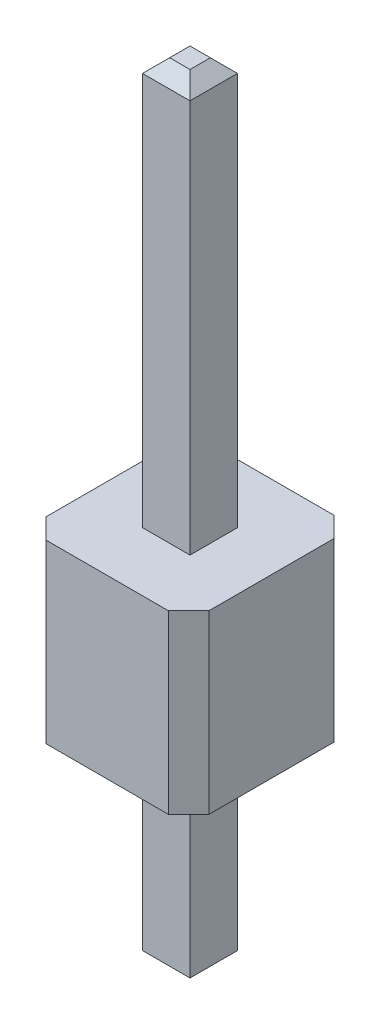
ISO-10303-21;
HEADER;
FILE_DESCRIPTION(('STEP AP214'),'2;1');
FILE_NAME('part.step','',(''),(''),'','','');
FILE_SCHEMA(('AUTOMOTIVE_DESIGN { 1 0 10303 214 1 1 1 1 }'));
ENDSEC;
DATA;
#1=APPLICATION_CONTEXT('core data for automotive mechanical design processes');
#2=APPLICATION_PROTOCOL_DEFINITION('international standard','automotive_design',2000,#1);
#3=PRODUCT_CONTEXT('',#1,'mechanical');
#4=PRODUCT('Part','Part','',(#3));
#5=PRODUCT_RELATED_PRODUCT_CATEGORY('part','',(#4));
#6=PRODUCT_DEFINITION_FORMATION('','',#4);
#7=PRODUCT_DEFINITION_CONTEXT('part definition',#1,'design');
#8=PRODUCT_DEFINITION('design','',#6,#7);
#9=PRODUCT_DEFINITION_SHAPE('','',#8);
#10=(LENGTH_UNIT() NAMED_UNIT(*) SI_UNIT(.MILLI.,.METRE.));
#11=(NAMED_UNIT(*) PLANE_ANGLE_UNIT() SI_UNIT($,.RADIAN.));
#12=(NAMED_UNIT(*) SI_UNIT($,.STERADIAN.) SOLID_ANGLE_UNIT());
#13=UNCERTAINTY_MEASURE_WITH_UNIT(LENGTH_MEASURE(1.E-05),#10,'distance_accuracy_value','');
#14=(GEOMETRIC_REPRESENTATION_CONTEXT(3) GLOBAL_UNCERTAINTY_ASSIGNED_CONTEXT((#13)) GLOBAL_UNIT_ASSIGNED_CONTEXT((#10,
#11,#12)) REPRESENTATION_CONTEXT('',''));
#15=CARTESIAN_POINT('',(0.,0.,0.));
#16=DIRECTION('',(0.,0.,1.));
#17=DIRECTION('',(1.,0.,0.));
#18=AXIS2_PLACEMENT_3D('',#15,#16,#17);
#19=CARTESIAN_POINT('',(0.,0.,0.));
#20=DIRECTION('',(0.,-1.,0.));
#21=DIRECTION('',(0.,0.,-1.));
#22=AXIS2_PLACEMENT_3D('',#19,#20,#21);
#23=PLANE('',#22);
#24=DIRECTION('',(-1.,0.,0.));
#25=VECTOR('',#24,1.);
#26=CARTESIAN_POINT('',(-2.34186046511628,0.,-1.98139534883721));
#27=LINE('',#26,#25);
#28=CARTESIAN_POINT('',(-0.541860465116279,0.,-1.98139534883721));
#29=VERTEX_POINT('',#28);
#30=CARTESIAN_POINT('',(-2.34186046511628,0.,-1.98139534883721));
#31=VERTEX_POINT('',#30);
#32=EDGE_CURVE('E231',#29,#31,#27,.T.);
#33=ORIENTED_EDGE('',*,*,#32,.F.);
#34=DIRECTION('',(-0.707106781186548,0.,-0.707106781186547));
#35=VECTOR('',#34,1.);
#36=CARTESIAN_POINT('',(-0.541860465116279,0.,-1.98139534883721));
#37=LINE('',#36,#35);
#38=CARTESIAN_POINT('',(-0.241860465116279,0.,-1.68139534883721));
#39=VERTEX_POINT('',#38);
#40=EDGE_CURVE('E236',#39,#29,#37,.T.);
#41=ORIENTED_EDGE('',*,*,#40,.F.);
#42=DIRECTION('',(0.,0.,-1.));
#43=VECTOR('',#42,1.);
#44=CARTESIAN_POINT('',(-0.241860465116279,0.,-1.68139534883721));
#45=LINE('',#44,#43);
#46=CARTESIAN_POINT('',(-0.241860465116279,0.,0.158604651162792));
#47=VERTEX_POINT('',#46);
#48=EDGE_CURVE('E263',#47,#39,#45,.T.);
#49=ORIENTED_EDGE('',*,*,#48,.F.);
#50=DIRECTION('',(0.707106781186547,0.,-0.707106781186548));
#51=VECTOR('',#50,1.);
#52=CARTESIAN_POINT('',(-0.541860465116279,0.,0.458604651162792));
#53=LINE('',#52,#51);
#54=CARTESIAN_POINT('',(-0.541860465116279,0.,0.458604651162792));
#55=VERTEX_POINT('',#54);
#56=EDGE_CURVE('E261',#55,#47,#53,.T.);
#57=ORIENTED_EDGE('',*,*,#56,.F.);
#58=DIRECTION('',(1.,0.,0.));
#59=VECTOR('',#58,1.);
#60=CARTESIAN_POINT('',(-2.34186046511628,0.,0.458604651162792));
#61=LINE('',#60,#59);
#62=CARTESIAN_POINT('',(-2.34186046511628,0.,0.458604651162792));
#63=VERTEX_POINT('',#62);
#64=EDGE_CURVE('E259',#63,#55,#61,.T.);
#65=ORIENTED_EDGE('',*,*,#64,.F.);
#66=DIRECTION('',(0.707106781186547,0.,0.707106781186548));
#67=VECTOR('',#66,1.);
#68=CARTESIAN_POINT('',(-2.64186046511628,0.,0.158604651162792));
#69=LINE('',#68,#67);
#70=CARTESIAN_POINT('',(-2.64186046511628,0.,0.158604651162792));
#71=VERTEX_POINT('',#70);
#72=EDGE_CURVE('E257',#71,#63,#69,.T.);
#73=ORIENTED_EDGE('',*,*,#72,.F.);
#74=DIRECTION('',(0.,0.,1.));
#75=VECTOR('',#74,1.);
#76=CARTESIAN_POINT('',(-2.64186046511628,0.,-1.68139534883721));
#77=LINE('',#76,#75);
#78=CARTESIAN_POINT('',(-2.64186046511628,0.,-1.68139534883721));
#79=VERTEX_POINT('',#78);
#80=EDGE_CURVE('E255',#79,#71,#77,.T.);
#81=ORIENTED_EDGE('',*,*,#80,.F.);
#82=DIRECTION('',(-0.707106781186547,0.,0.707106781186547));
#83=VECTOR('',#82,1.);
#84=CARTESIAN_POINT('',(-2.64186046511628,0.,-1.68139534883721));
#85=LINE('',#84,#83);
#86=EDGE_CURVE('E253',#31,#79,#85,.T.);
#87=ORIENTED_EDGE('',*,*,#86,.F.);
#88=EDGE_LOOP('',(#33,#41,#49,#57,#65,#73,#81,#87));
#89=FACE_BOUND('',#88,.T.);
#90=DIRECTION('',(0.,0.,1.));
#91=VECTOR('',#90,1.);
#92=CARTESIAN_POINT('',(-1.09186046511628,0.,-0.411395348837209));
#93=LINE('',#92,#91);
#94=CARTESIAN_POINT('',(-1.09186046511628,0.,-1.11139534883721));
#95=VERTEX_POINT('',#94);
#96=CARTESIAN_POINT('',(-1.09186046511628,0.,-0.411395348837209));
#97=VERTEX_POINT('',#96);
#98=EDGE_CURVE('E182',#95,#97,#93,.T.);
#99=ORIENTED_EDGE('',*,*,#98,.F.);
#100=DIRECTION('',(1.,0.,0.));
#101=VECTOR('',#100,1.);
#102=CARTESIAN_POINT('',(-1.09186046511628,0.,-1.11139534883721));
#103=LINE('',#102,#101);
#104=CARTESIAN_POINT('',(-1.79186046511628,0.,-1.11139534883721));
#105=VERTEX_POINT('',#104);
#106=EDGE_CURVE('E192',#105,#95,#103,.T.);
#107=ORIENTED_EDGE('',*,*,#106,.F.);
#108=DIRECTION('',(0.,0.,-1.));
#109=VECTOR('',#108,1.);
#110=CARTESIAN_POINT('',(-1.79186046511628,0.,-1.11139534883721));
#111=LINE('',#110,#109);
#112=CARTESIAN_POINT('',(-1.79186046511628,0.,-0.411395348837209));
#113=VERTEX_POINT('',#112);
#114=EDGE_CURVE('E204',#113,#105,#111,.T.);
#115=ORIENTED_EDGE('',*,*,#114,.F.);
#116=DIRECTION('',(-1.,0.,0.));
#117=VECTOR('',#116,1.);
#118=CARTESIAN_POINT('',(-1.79186046511628,0.,-0.411395348837209));
#119=LINE('',#118,#117);
#120=EDGE_CURVE('E202',#97,#113,#119,.T.);
#121=ORIENTED_EDGE('',*,*,#120,.F.);
#122=EDGE_LOOP('',(#99,#107,#115,#121));
#123=FACE_BOUND('',#122,.T.);
#124=ADVANCED_FACE('F40',(#89,#123),#23,.T.);
#125=CARTESIAN_POINT('',(0.,2.6,0.));
#126=DIRECTION('',(0.,-1.,0.));
#127=DIRECTION('',(0.,0.,-1.));
#128=AXIS2_PLACEMENT_3D('',#125,#126,#127);
#129=PLANE('',#128);
#130=DIRECTION('',(-1.,0.,0.));
#131=VECTOR('',#130,1.);
#132=CARTESIAN_POINT('',(-2.34186046511628,2.6,-1.98139534883721));
#133=LINE('',#132,#131);
#134=CARTESIAN_POINT('',(-0.541860465116279,2.6,-1.98139534883721));
#135=VERTEX_POINT('',#134);
#136=CARTESIAN_POINT('',(-2.34186046511628,2.6,-1.98139534883721));
#137=VERTEX_POINT('',#136);
#138=EDGE_CURVE('E232',#135,#137,#133,.T.);
#139=ORIENTED_EDGE('',*,*,#138,.T.);
#140=DIRECTION('',(-0.707106781186547,0.,0.707106781186547));
#141=VECTOR('',#140,1.);
#142=CARTESIAN_POINT('',(-2.64186046511628,2.6,-1.68139534883721));
#143=LINE('',#142,#141);
#144=CARTESIAN_POINT('',(-2.64186046511628,2.6,-1.68139534883721));
#145=VERTEX_POINT('',#144);
#146=EDGE_CURVE('E235',#137,#145,#143,.T.);
#147=ORIENTED_EDGE('',*,*,#146,.T.);
#148=DIRECTION('',(0.,0.,1.));
#149=VECTOR('',#148,1.);
#150=CARTESIAN_POINT('',(-2.64186046511628,2.6,-1.68139534883721));
#151=LINE('',#150,#149);
#152=CARTESIAN_POINT('',(-2.64186046511628,2.6,0.158604651162792));
#153=VERTEX_POINT('',#152);
#154=EDGE_CURVE('E238',#145,#153,#151,.T.);
#155=ORIENTED_EDGE('',*,*,#154,.T.);
#156=DIRECTION('',(0.707106781186547,0.,0.707106781186548));
#157=VECTOR('',#156,1.);
#158=CARTESIAN_POINT('',(-2.64186046511628,2.6,0.158604651162792));
#159=LINE('',#158,#157);
#160=CARTESIAN_POINT('',(-2.34186046511628,2.6,0.458604651162792));
#161=VERTEX_POINT('',#160);
#162=EDGE_CURVE('E240',#153,#161,#159,.T.);
#163=ORIENTED_EDGE('',*,*,#162,.T.);
#164=DIRECTION('',(1.,0.,0.));
#165=VECTOR('',#164,1.);
#166=CARTESIAN_POINT('',(-2.34186046511628,2.6,0.458604651162792));
#167=LINE('',#166,#165);
#168=CARTESIAN_POINT('',(-0.541860465116279,2.6,0.458604651162792));
#169=VERTEX_POINT('',#168);
#170=EDGE_CURVE('E242',#161,#169,#167,.T.);
#171=ORIENTED_EDGE('',*,*,#170,.T.);
#172=DIRECTION('',(0.707106781186547,0.,-0.707106781186548));
#173=VECTOR('',#172,1.);
#174=CARTESIAN_POINT('',(-0.541860465116279,2.6,0.458604651162792));
#175=LINE('',#174,#173);
#176=CARTESIAN_POINT('',(-0.241860465116279,2.6,0.158604651162792));
#177=VERTEX_POINT('',#176);
#178=EDGE_CURVE('E244',#169,#177,#175,.T.);
#179=ORIENTED_EDGE('',*,*,#178,.T.);
#180=DIRECTION('',(0.,0.,-1.));
#181=VECTOR('',#180,1.);
#182=CARTESIAN_POINT('',(-0.241860465116279,2.6,-1.68139534883721));
#183=LINE('',#182,#181);
#184=CARTESIAN_POINT('',(-0.241860465116279,2.6,-1.68139534883721));
#185=VERTEX_POINT('',#184);
#186=EDGE_CURVE('E246',#177,#185,#183,.T.);
#187=ORIENTED_EDGE('',*,*,#186,.T.);
#188=DIRECTION('',(-0.707106781186548,0.,-0.707106781186547));
#189=VECTOR('',#188,1.);
#190=CARTESIAN_POINT('',(-0.541860465116279,2.6,-1.98139534883721));
#191=LINE('',#190,#189);
#192=EDGE_CURVE('E248',#185,#135,#191,.T.);
#193=ORIENTED_EDGE('',*,*,#192,.T.);
#194=EDGE_LOOP('',(#139,#147,#155,#163,#171,#179,#187,#193));
#195=FACE_BOUND('',#194,.T.);
#196=DIRECTION('',(0.,0.,-1.));
#197=VECTOR('',#196,1.);
#198=CARTESIAN_POINT('',(-1.09186046511628,2.6,-1.11139534883721));
#199=LINE('',#198,#197);
#200=CARTESIAN_POINT('',(-1.09186046511628,2.6,-0.411395348837209));
#201=VERTEX_POINT('',#200);
#202=CARTESIAN_POINT('',(-1.09186046511628,2.6,-1.11139534883721));
#203=VERTEX_POINT('',#202);
#204=EDGE_CURVE('E188',#201,#203,#199,.T.);
#205=ORIENTED_EDGE('',*,*,#204,.F.);
#206=DIRECTION('',(1.,0.,0.));
#207=VECTOR('',#206,1.);
#208=CARTESIAN_POINT('',(-1.79186046511628,2.6,-0.411395348837209));
#209=LINE('',#208,#207);
#210=CARTESIAN_POINT('',(-1.79186046511628,2.6,-0.411395348837209));
#211=VERTEX_POINT('',#210);
#212=EDGE_CURVE('E220',#211,#201,#209,.T.);
#213=ORIENTED_EDGE('',*,*,#212,.F.);
#214=DIRECTION('',(0.,0.,1.));
#215=VECTOR('',#214,1.);
#216=CARTESIAN_POINT('',(-1.79186046511628,2.6,-1.11139534883721));
#217=LINE('',#216,#215);
#218=CARTESIAN_POINT('',(-1.79186046511628,2.6,-1.11139534883721));
#219=VERTEX_POINT('',#218);
#220=EDGE_CURVE('E217',#219,#211,#217,.T.);
#221=ORIENTED_EDGE('',*,*,#220,.F.);
#222=DIRECTION('',(-1.,0.,0.));
#223=VECTOR('',#222,1.);
#224=CARTESIAN_POINT('',(-1.79186046511628,2.6,-1.11139534883721));
#225=LINE('',#224,#223);
#226=EDGE_CURVE('E214',#203,#219,#225,.T.);
#227=ORIENTED_EDGE('',*,*,#226,.F.);
#228=EDGE_LOOP('',(#205,#213,#221,#227));
#229=FACE_BOUND('',#228,.T.);
#230=ADVANCED_FACE('F372',(#195,#229),#129,.F.);
#231=CARTESIAN_POINT('',(-2.34186046511628,2.6,-1.98139534883721));
#232=DIRECTION('',(0.,0.,1.));
#233=DIRECTION('',(1.,0.,0.));
#234=AXIS2_PLACEMENT_3D('',#231,#232,#233);
#235=PLANE('',#234);
#236=ORIENTED_EDGE('',*,*,#32,.T.);
#237=DIRECTION('',(0.,-1.,0.));
#238=VECTOR('',#237,1.);
#239=CARTESIAN_POINT('',(-2.34186046511628,2.6,-1.98139534883721));
#240=LINE('',#239,#238);
#241=EDGE_CURVE('E286',#137,#31,#240,.T.);
#242=ORIENTED_EDGE('',*,*,#241,.F.);
#243=ORIENTED_EDGE('',*,*,#138,.F.);
#244=DIRECTION('',(0.,-1.,0.));
#245=VECTOR('',#244,1.);
#246=CARTESIAN_POINT('',(-0.541860465116279,2.6,-1.98139534883721));
#247=LINE('',#246,#245);
#248=EDGE_CURVE('E250',#135,#29,#247,.T.);
#249=ORIENTED_EDGE('',*,*,#248,.T.);
#250=EDGE_LOOP('',(#236,#242,#243,#249));
#251=FACE_BOUND('',#250,.T.);
#252=ADVANCED_FACE('F378',(#251),#235,.F.);
#253=CARTESIAN_POINT('',(-2.64186046511628,2.6,-1.68139534883721));
#254=DIRECTION('',(0.707106781186548,0.,0.707106781186548));
#255=DIRECTION('',(0.707106781186548,0.,-0.707106781186548));
#256=AXIS2_PLACEMENT_3D('',#253,#254,#255);
#257=PLANE('',#256);
#258=ORIENTED_EDGE('',*,*,#86,.T.);
#259=DIRECTION('',(0.,-1.,0.));
#260=VECTOR('',#259,1.);
#261=CARTESIAN_POINT('',(-2.64186046511628,2.6,-1.68139534883721));
#262=LINE('',#261,#260);
#263=EDGE_CURVE('E283',#145,#79,#262,.T.);
#264=ORIENTED_EDGE('',*,*,#263,.F.);
#265=ORIENTED_EDGE('',*,*,#146,.F.);
#266=ORIENTED_EDGE('',*,*,#241,.T.);
#267=EDGE_LOOP('',(#258,#264,#265,#266));
#268=FACE_BOUND('',#267,.T.);
#269=ADVANCED_FACE('F407',(#268),#257,.F.);
#270=CARTESIAN_POINT('',(-2.64186046511628,2.6,-1.68139534883721));
#271=DIRECTION('',(1.,0.,0.));
#272=DIRECTION('',(0.,0.,-1.));
#273=AXIS2_PLACEMENT_3D('',#270,#271,#272);
#274=PLANE('',#273);
#275=ORIENTED_EDGE('',*,*,#80,.T.);
#276=DIRECTION('',(0.,-1.,0.));
#277=VECTOR('',#276,1.);
#278=CARTESIAN_POINT('',(-2.64186046511628,2.6,0.158604651162792));
#279=LINE('',#278,#277);
#280=EDGE_CURVE('E280',#153,#71,#279,.T.);
#281=ORIENTED_EDGE('',*,*,#280,.F.);
#282=ORIENTED_EDGE('',*,*,#154,.F.);
#283=ORIENTED_EDGE('',*,*,#263,.T.);
#284=EDGE_LOOP('',(#275,#281,#282,#283));
#285=FACE_BOUND('',#284,.T.);
#286=ADVANCED_FACE('F403',(#285),#274,.F.);
#287=CARTESIAN_POINT('',(-2.64186046511628,2.6,0.158604651162792));
#288=DIRECTION('',(0.707106781186548,0.,-0.707106781186547));
#289=DIRECTION('',(-0.707106781186547,0.,-0.707106781186548));
#290=AXIS2_PLACEMENT_3D('',#287,#288,#289);
#291=PLANE('',#290);
#292=ORIENTED_EDGE('',*,*,#72,.T.);
#293=DIRECTION('',(0.,-1.,0.));
#294=VECTOR('',#293,1.);
#295=CARTESIAN_POINT('',(-2.34186046511628,2.6,0.458604651162792));
#296=LINE('',#295,#294);
#297=EDGE_CURVE('E277',#161,#63,#296,.T.);
#298=ORIENTED_EDGE('',*,*,#297,.F.);
#299=ORIENTED_EDGE('',*,*,#162,.F.);
#300=ORIENTED_EDGE('',*,*,#280,.T.);
#301=EDGE_LOOP('',(#292,#298,#299,#300));
#302=FACE_BOUND('',#301,.T.);
#303=ADVANCED_FACE('F399',(#302),#291,.F.);
#304=CARTESIAN_POINT('',(-2.34186046511628,2.6,0.458604651162792));
#305=DIRECTION('',(0.,0.,-1.));
#306=DIRECTION('',(-1.,0.,0.));
#307=AXIS2_PLACEMENT_3D('',#304,#305,#306);
#308=PLANE('',#307);
#309=ORIENTED_EDGE('',*,*,#64,.T.);
#310=DIRECTION('',(0.,-1.,0.));
#311=VECTOR('',#310,1.);
#312=CARTESIAN_POINT('',(-0.541860465116279,2.6,0.458604651162792));
#313=LINE('',#312,#311);
#314=EDGE_CURVE('E274',#169,#55,#313,.T.);
#315=ORIENTED_EDGE('',*,*,#314,.F.);
#316=ORIENTED_EDGE('',*,*,#170,.F.);
#317=ORIENTED_EDGE('',*,*,#297,.T.);
#318=EDGE_LOOP('',(#309,#315,#316,#317));
#319=FACE_BOUND('',#318,.T.);
#320=ADVANCED_FACE('F395',(#319),#308,.F.);
#321=CARTESIAN_POINT('',(-0.541860465116279,2.6,0.458604651162792));
#322=DIRECTION('',(-0.707106781186548,0.,-0.707106781186547));
#323=DIRECTION('',(-0.707106781186547,0.,0.707106781186548));
#324=AXIS2_PLACEMENT_3D('',#321,#322,#323);
#325=PLANE('',#324);
#326=ORIENTED_EDGE('',*,*,#56,.T.);
#327=DIRECTION('',(0.,-1.,0.));
#328=VECTOR('',#327,1.);
#329=CARTESIAN_POINT('',(-0.241860465116279,2.6,0.158604651162792));
#330=LINE('',#329,#328);
#331=EDGE_CURVE('E271',#177,#47,#330,.T.);
#332=ORIENTED_EDGE('',*,*,#331,.F.);
#333=ORIENTED_EDGE('',*,*,#178,.F.);
#334=ORIENTED_EDGE('',*,*,#314,.T.);
#335=EDGE_LOOP('',(#326,#332,#333,#334));
#336=FACE_BOUND('',#335,.T.);
#337=ADVANCED_FACE('F391',(#336),#325,.F.);
#338=CARTESIAN_POINT('',(-0.241860465116279,2.6,-1.68139534883721));
#339=DIRECTION('',(-1.,0.,0.));
#340=DIRECTION('',(0.,0.,1.));
#341=AXIS2_PLACEMENT_3D('',#338,#339,#340);
#342=PLANE('',#341);
#343=ORIENTED_EDGE('',*,*,#48,.T.);
#344=DIRECTION('',(0.,-1.,0.));
#345=VECTOR('',#344,1.);
#346=CARTESIAN_POINT('',(-0.241860465116279,2.6,-1.68139534883721));
#347=LINE('',#346,#345);
#348=EDGE_CURVE('E268',#185,#39,#347,.T.);
#349=ORIENTED_EDGE('',*,*,#348,.F.);
#350=ORIENTED_EDGE('',*,*,#186,.F.);
#351=ORIENTED_EDGE('',*,*,#331,.T.);
#352=EDGE_LOOP('',(#343,#349,#350,#351));
#353=FACE_BOUND('',#352,.T.);
#354=ADVANCED_FACE('F387',(#353),#342,.F.);
#355=CARTESIAN_POINT('',(-0.541860465116279,2.6,-1.98139534883721));
#356=DIRECTION('',(-0.707106781186547,0.,0.707106781186548));
#357=DIRECTION('',(0.707106781186548,0.,0.707106781186547));
#358=AXIS2_PLACEMENT_3D('',#355,#356,#357);
#359=PLANE('',#358);
#360=ORIENTED_EDGE('',*,*,#40,.T.);
#361=ORIENTED_EDGE('',*,*,#248,.F.);
#362=ORIENTED_EDGE('',*,*,#192,.F.);
#363=ORIENTED_EDGE('',*,*,#348,.T.);
#364=EDGE_LOOP('',(#360,#361,#362,#363));
#365=FACE_BOUND('',#364,.T.);
#366=ADVANCED_FACE('F384',(#365),#359,.F.);
#367=CARTESIAN_POINT('',(-1.09186046511628,8.6,-1.11139534883721));
#368=DIRECTION('',(-1.,0.,0.));
#369=DIRECTION('',(0.,0.,1.));
#370=AXIS2_PLACEMENT_3D('',#367,#368,#369);
#371=PLANE('',#370);
#372=DIRECTION('',(0.,-1.,0.));
#373=VECTOR('',#372,1.);
#374=CARTESIAN_POINT('',(-1.09186046511628,8.6,-1.11139534883721));
#375=LINE('',#374,#373);
#376=CARTESIAN_POINT('',(-1.09186046511628,8.4,-1.11139534883721));
#377=VERTEX_POINT('',#376);
#378=EDGE_CURVE('E229',#377,#203,#375,.T.);
#379=ORIENTED_EDGE('',*,*,#378,.F.);
#380=DIRECTION('',(0.,0.,1.));
#381=VECTOR('',#380,1.);
#382=CARTESIAN_POINT('',(-1.09186046511628,8.4,-0.411395348837209));
#383=LINE('',#382,#381);
#384=CARTESIAN_POINT('',(-1.09186046511628,8.4,-0.411395348837209));
#385=VERTEX_POINT('',#384);
#386=EDGE_CURVE('E318',#377,#385,#383,.T.);
#387=ORIENTED_EDGE('',*,*,#386,.T.);
#388=DIRECTION('',(0.,-1.,0.));
#389=VECTOR('',#388,1.);
#390=CARTESIAN_POINT('',(-1.09186046511628,8.6,-0.411395348837209));
#391=LINE('',#390,#389);
#392=EDGE_CURVE('E223',#385,#201,#391,.T.);
#393=ORIENTED_EDGE('',*,*,#392,.T.);
#394=ORIENTED_EDGE('',*,*,#204,.T.);
#395=EDGE_LOOP('',(#379,#387,#393,#394));
#396=FACE_BOUND('',#395,.T.);
#397=ADVANCED_FACE('F351',(#396),#371,.F.);
#398=CARTESIAN_POINT('',(-1.79186046511628,8.6,-1.11139534883721));
#399=DIRECTION('',(0.,0.,1.));
#400=DIRECTION('',(1.,0.,0.));
#401=AXIS2_PLACEMENT_3D('',#398,#399,#400);
#402=PLANE('',#401);
#403=DIRECTION('',(0.,-1.,0.));
#404=VECTOR('',#403,1.);
#405=CARTESIAN_POINT('',(-1.79186046511628,8.6,-1.11139534883721));
#406=LINE('',#405,#404);
#407=CARTESIAN_POINT('',(-1.79186046511628,8.4,-1.11139534883721));
#408=VERTEX_POINT('',#407);
#409=EDGE_CURVE('E227',#408,#219,#406,.T.);
#410=ORIENTED_EDGE('',*,*,#409,.F.);
#411=DIRECTION('',(1.,0.,0.));
#412=VECTOR('',#411,1.);
#413=CARTESIAN_POINT('',(-1.09186046511628,8.4,-1.11139534883721));
#414=LINE('',#413,#412);
#415=EDGE_CURVE('E49',#408,#377,#414,.T.);
#416=ORIENTED_EDGE('',*,*,#415,.T.);
#417=ORIENTED_EDGE('',*,*,#378,.T.);
#418=ORIENTED_EDGE('',*,*,#226,.T.);
#419=EDGE_LOOP('',(#410,#416,#417,#418));
#420=FACE_BOUND('',#419,.T.);
#421=ADVANCED_FACE('F571',(#420),#402,.F.);
#422=CARTESIAN_POINT('',(-1.79186046511628,8.6,-1.11139534883721));
#423=DIRECTION('',(1.,0.,0.));
#424=DIRECTION('',(0.,0.,-1.));
#425=AXIS2_PLACEMENT_3D('',#422,#423,#424);
#426=PLANE('',#425);
#427=DIRECTION('',(0.,-1.,0.));
#428=VECTOR('',#427,1.);
#429=CARTESIAN_POINT('',(-1.79186046511628,8.6,-0.411395348837209));
#430=LINE('',#429,#428);
#431=CARTESIAN_POINT('',(-1.79186046511628,8.4,-0.411395348837209));
#432=VERTEX_POINT('',#431);
#433=EDGE_CURVE('E225',#432,#211,#430,.T.);
#434=ORIENTED_EDGE('',*,*,#433,.F.);
#435=DIRECTION('',(0.,0.,-1.));
#436=VECTOR('',#435,1.);
#437=CARTESIAN_POINT('',(-1.79186046511628,8.4,-1.11139534883721));
#438=LINE('',#437,#436);
#439=EDGE_CURVE('E11',#432,#408,#438,.T.);
#440=ORIENTED_EDGE('',*,*,#439,.T.);
#441=ORIENTED_EDGE('',*,*,#409,.T.);
#442=ORIENTED_EDGE('',*,*,#220,.T.);
#443=EDGE_LOOP('',(#434,#440,#441,#442));
#444=FACE_BOUND('',#443,.T.);
#445=ADVANCED_FACE('F369',(#444),#426,.F.);
#446=CARTESIAN_POINT('',(-1.79186046511628,8.6,-0.411395348837209));
#447=DIRECTION('',(0.,0.,-1.));
#448=DIRECTION('',(-1.,0.,0.));
#449=AXIS2_PLACEMENT_3D('',#446,#447,#448);
#450=PLANE('',#449);
#451=ORIENTED_EDGE('',*,*,#392,.F.);
#452=DIRECTION('',(-1.,0.,0.));
#453=VECTOR('',#452,1.);
#454=CARTESIAN_POINT('',(-1.79186046511628,8.4,-0.411395348837209));
#455=LINE('',#454,#453);
#456=EDGE_CURVE('E315',#385,#432,#455,.T.);
#457=ORIENTED_EDGE('',*,*,#456,.T.);
#458=ORIENTED_EDGE('',*,*,#433,.T.);
#459=ORIENTED_EDGE('',*,*,#212,.T.);
#460=EDGE_LOOP('',(#451,#457,#458,#459));
#461=FACE_BOUND('',#460,.T.);
#462=ADVANCED_FACE('F355',(#461),#450,.F.);
#463=CARTESIAN_POINT('',(0.,8.6,0.));
#464=DIRECTION('',(0.,1.,0.));
#465=DIRECTION('',(0.,0.,1.));
#466=AXIS2_PLACEMENT_3D('',#463,#464,#465);
#467=PLANE('',#466);
#468=DIRECTION('',(0.,0.,1.));
#469=VECTOR('',#468,1.);
#470=CARTESIAN_POINT('',(-1.59186046511628,8.6,-0.411395348837209));
#471=LINE('',#470,#469);
#472=CARTESIAN_POINT('',(-1.59186046511628,8.6,-0.91139534883721));
#473=VERTEX_POINT('',#472);
#474=CARTESIAN_POINT('',(-1.59186046511628,8.6,-0.611395348837207));
#475=VERTEX_POINT('',#474);
#476=EDGE_CURVE('E306',#473,#475,#471,.T.);
#477=ORIENTED_EDGE('',*,*,#476,.T.);
#478=DIRECTION('',(1.,0.,0.));
#479=VECTOR('',#478,1.);
#480=CARTESIAN_POINT('',(-1.09186046511628,8.6,-0.611395348837207));
#481=LINE('',#480,#479);
#482=CARTESIAN_POINT('',(-1.29186046511628,8.6,-0.611395348837207));
#483=VERTEX_POINT('',#482);
#484=EDGE_CURVE('E312',#475,#483,#481,.T.);
#485=ORIENTED_EDGE('',*,*,#484,.T.);
#486=DIRECTION('',(0.,0.,-1.));
#487=VECTOR('',#486,1.);
#488=CARTESIAN_POINT('',(-1.29186046511628,8.6,-1.11139534883721));
#489=LINE('',#488,#487);
#490=CARTESIAN_POINT('',(-1.29186046511628,8.6,-0.91139534883721));
#491=VERTEX_POINT('',#490);
#492=EDGE_CURVE('E310',#483,#491,#489,.T.);
#493=ORIENTED_EDGE('',*,*,#492,.T.);
#494=DIRECTION('',(-1.,0.,0.));
#495=VECTOR('',#494,1.);
#496=CARTESIAN_POINT('',(-1.79186046511628,8.6,-0.91139534883721));
#497=LINE('',#496,#495);
#498=EDGE_CURVE('E308',#491,#473,#497,.T.);
#499=ORIENTED_EDGE('',*,*,#498,.T.);
#500=EDGE_LOOP('',(#477,#485,#493,#499));
#501=FACE_BOUND('',#500,.T.);
#502=ADVANCED_FACE('F361',(#501),#467,.T.);
#503=CARTESIAN_POINT('',(-1.09186046511628,-3.,-1.11139534883721));
#504=DIRECTION('',(0.,0.,1.));
#505=DIRECTION('',(1.,0.,0.));
#506=AXIS2_PLACEMENT_3D('',#503,#504,#505);
#507=PLANE('',#506);
#508=DIRECTION('',(0.,1.,0.));
#509=VECTOR('',#508,1.);
#510=CARTESIAN_POINT('',(-1.09186046511628,-3.,-1.11139534883721));
#511=LINE('',#510,#509);
#512=CARTESIAN_POINT('',(-1.09186046511628,-2.8,-1.11139534883721));
#513=VERTEX_POINT('',#512);
#514=EDGE_CURVE('E177',#513,#95,#511,.T.);
#515=ORIENTED_EDGE('',*,*,#514,.F.);
#516=DIRECTION('',(-1.,0.,0.));
#517=VECTOR('',#516,1.);
#518=CARTESIAN_POINT('',(-1.09186046511628,-2.8,-1.11139534883721));
#519=LINE('',#518,#517);
#520=CARTESIAN_POINT('',(-1.79186046511628,-2.8,-1.11139534883721));
#521=VERTEX_POINT('',#520);
#522=EDGE_CURVE('E304',#513,#521,#519,.T.);
#523=ORIENTED_EDGE('',*,*,#522,.T.);
#524=DIRECTION('',(0.,1.,0.));
#525=VECTOR('',#524,1.);
#526=CARTESIAN_POINT('',(-1.79186046511628,-3.,-1.11139534883721));
#527=LINE('',#526,#525);
#528=EDGE_CURVE('E195',#521,#105,#527,.T.);
#529=ORIENTED_EDGE('',*,*,#528,.T.);
#530=ORIENTED_EDGE('',*,*,#106,.T.);
#531=EDGE_LOOP('',(#515,#523,#529,#530));
#532=FACE_BOUND('',#531,.T.);
#533=ADVANCED_FACE('F193',(#532),#507,.F.);
#534=CARTESIAN_POINT('',(-1.09186046511628,-3.,-0.411395348837209));
#535=DIRECTION('',(-1.,0.,0.));
#536=DIRECTION('',(0.,0.,1.));
#537=AXIS2_PLACEMENT_3D('',#534,#535,#536);
#538=PLANE('',#537);
#539=DIRECTION('',(0.,1.,0.));
#540=VECTOR('',#539,1.);
#541=CARTESIAN_POINT('',(-1.09186046511628,-3.,-0.411395348837209));
#542=LINE('',#541,#540);
#543=CARTESIAN_POINT('',(-1.09186046511628,-2.8,-0.411395348837209));
#544=VERTEX_POINT('',#543);
#545=EDGE_CURVE('E189',#544,#97,#542,.T.);
#546=ORIENTED_EDGE('',*,*,#545,.F.);
#547=DIRECTION('',(0.,0.,-1.));
#548=VECTOR('',#547,1.);
#549=CARTESIAN_POINT('',(-1.09186046511628,-2.8,-0.411395348837209));
#550=LINE('',#549,#548);
#551=EDGE_CURVE('E185',#544,#513,#550,.T.);
#552=ORIENTED_EDGE('',*,*,#551,.T.);
#553=ORIENTED_EDGE('',*,*,#514,.T.);
#554=ORIENTED_EDGE('',*,*,#98,.T.);
#555=EDGE_LOOP('',(#546,#552,#553,#554));
#556=FACE_BOUND('',#555,.T.);
#557=ADVANCED_FACE('F180',(#556),#538,.F.);
#558=CARTESIAN_POINT('',(-1.79186046511628,-3.,-0.411395348837209));
#559=DIRECTION('',(0.,0.,-1.));
#560=DIRECTION('',(-1.,0.,0.));
#561=AXIS2_PLACEMENT_3D('',#558,#559,#560);
#562=PLANE('',#561);
#563=DIRECTION('',(0.,1.,0.));
#564=VECTOR('',#563,1.);
#565=CARTESIAN_POINT('',(-1.79186046511628,-3.,-0.411395348837209));
#566=LINE('',#565,#564);
#567=CARTESIAN_POINT('',(-1.79186046511628,-2.8,-0.411395348837209));
#568=VERTEX_POINT('',#567);
#569=EDGE_CURVE('E209',#568,#113,#566,.T.);
#570=ORIENTED_EDGE('',*,*,#569,.F.);
#571=DIRECTION('',(1.,0.,0.));
#572=VECTOR('',#571,1.);
#573=CARTESIAN_POINT('',(-1.79186046511628,-2.8,-0.411395348837209));
#574=LINE('',#573,#572);
#575=EDGE_CURVE('E301',#568,#544,#574,.T.);
#576=ORIENTED_EDGE('',*,*,#575,.T.);
#577=ORIENTED_EDGE('',*,*,#545,.T.);
#578=ORIENTED_EDGE('',*,*,#120,.T.);
#579=EDGE_LOOP('',(#570,#576,#577,#578));
#580=FACE_BOUND('',#579,.T.);
#581=ADVANCED_FACE('F473',(#580),#562,.F.);
#582=CARTESIAN_POINT('',(-1.79186046511628,-3.,-1.11139534883721));
#583=DIRECTION('',(1.,0.,0.));
#584=DIRECTION('',(0.,0.,-1.));
#585=AXIS2_PLACEMENT_3D('',#582,#583,#584);
#586=PLANE('',#585);
#587=ORIENTED_EDGE('',*,*,#528,.F.);
#588=DIRECTION('',(0.,0.,1.));
#589=VECTOR('',#588,1.);
#590=CARTESIAN_POINT('',(-1.79186046511628,-2.8,-1.11139534883721));
#591=LINE('',#590,#589);
#592=EDGE_CURVE('E298',#521,#568,#591,.T.);
#593=ORIENTED_EDGE('',*,*,#592,.T.);
#594=ORIENTED_EDGE('',*,*,#569,.T.);
#595=ORIENTED_EDGE('',*,*,#114,.T.);
#596=EDGE_LOOP('',(#587,#593,#594,#595));
#597=FACE_BOUND('',#596,.T.);
#598=ADVANCED_FACE('F465',(#597),#586,.F.);
#599=CARTESIAN_POINT('',(0.,-3.,0.));
#600=DIRECTION('',(0.,1.,0.));
#601=DIRECTION('',(0.,0.,1.));
#602=AXIS2_PLACEMENT_3D('',#599,#600,#601);
#603=PLANE('',#602);
#604=DIRECTION('',(-1.,0.,0.));
#605=VECTOR('',#604,1.);
#606=CARTESIAN_POINT('',(0.,-3.,-0.611395348837206));
#607=LINE('',#606,#605);
#608=CARTESIAN_POINT('',(-1.29186046511628,-3.,-0.611395348837206));
#609=VERTEX_POINT('',#608);
#610=CARTESIAN_POINT('',(-1.59186046511628,-3.,-0.611395348837206));
#611=VERTEX_POINT('',#610);
#612=EDGE_CURVE('E293',#609,#611,#607,.T.);
#613=ORIENTED_EDGE('',*,*,#612,.T.);
#614=DIRECTION('',(0.,0.,-1.));
#615=VECTOR('',#614,1.);
#616=CARTESIAN_POINT('',(-1.59186046511628,-3.,0.));
#617=LINE('',#616,#615);
#618=CARTESIAN_POINT('',(-1.59186046511628,-3.,-0.911395348837212));
#619=VERTEX_POINT('',#618);
#620=EDGE_CURVE('E295',#611,#619,#617,.T.);
#621=ORIENTED_EDGE('',*,*,#620,.T.);
#622=DIRECTION('',(1.,0.,0.));
#623=VECTOR('',#622,1.);
#624=CARTESIAN_POINT('',(0.,-3.,-0.911395348837212));
#625=LINE('',#624,#623);
#626=CARTESIAN_POINT('',(-1.29186046511628,-3.,-0.911395348837212));
#627=VERTEX_POINT('',#626);
#628=EDGE_CURVE('E289',#619,#627,#625,.T.);
#629=ORIENTED_EDGE('',*,*,#628,.T.);
#630=DIRECTION('',(0.,0.,1.));
#631=VECTOR('',#630,1.);
#632=CARTESIAN_POINT('',(-1.29186046511628,-3.,0.));
#633=LINE('',#632,#631);
#634=EDGE_CURVE('E291',#627,#609,#633,.T.);
#635=ORIENTED_EDGE('',*,*,#634,.T.);
#636=EDGE_LOOP('',(#613,#621,#629,#635));
#637=FACE_BOUND('',#636,.T.);
#638=ADVANCED_FACE('F430',(#637),#603,.F.);
#639=CARTESIAN_POINT('',(-1.29186046511628,-3.,0.));
#640=DIRECTION('',(-0.707106781186548,0.707106781186547,0.));
#641=DIRECTION('',(0.,0.,1.));
#642=AXIS2_PLACEMENT_3D('',#639,#640,#641);
#643=PLANE('',#642);
#644=DIRECTION('',(-0.577350269189626,-0.577350269189626,0.577350269189626));
#645=VECTOR('',#644,1.);
#646=CARTESIAN_POINT('',(-0.861240310077518,-2.56937984496124,-1.34201550387597));
#647=LINE('',#646,#645);
#648=EDGE_CURVE('E325',#513,#627,#647,.T.);
#649=ORIENTED_EDGE('',*,*,#648,.F.);
#650=ORIENTED_EDGE('',*,*,#551,.F.);
#651=DIRECTION('',(-0.577350269189626,-0.577350269189626,-0.577350269189626));
#652=VECTOR('',#651,1.);
#653=CARTESIAN_POINT('',(-1.08806201550387,-2.7962015503876,-0.407596899224804));
#654=LINE('',#653,#652);
#655=EDGE_CURVE('E199',#609,#544,#654,.F.);
#656=ORIENTED_EDGE('',*,*,#655,.F.);
#657=ORIENTED_EDGE('',*,*,#634,.F.);
#658=EDGE_LOOP('',(#649,#650,#656,#657));
#659=FACE_BOUND('',#658,.T.);
#660=ADVANCED_FACE('F426',(#659),#643,.F.);
#661=CARTESIAN_POINT('',(0.,-3.,-0.611395348837206));
#662=DIRECTION('',(0.,0.707106781186548,-0.707106781186548));
#663=DIRECTION('',(-1.,0.,0.));
#664=AXIS2_PLACEMENT_3D('',#661,#662,#663);
#665=PLANE('',#664);
#666=ORIENTED_EDGE('',*,*,#655,.T.);
#667=ORIENTED_EDGE('',*,*,#575,.F.);
#668=DIRECTION('',(0.577350269189626,-0.577350269189626,-0.577350269189626));
#669=VECTOR('',#668,1.);
#670=CARTESIAN_POINT('',(-1.06124031007752,-3.53062015503876,-1.14201550387597));
#671=LINE('',#670,#669);
#672=EDGE_CURVE('E323',#611,#568,#671,.F.);
#673=ORIENTED_EDGE('',*,*,#672,.F.);
#674=ORIENTED_EDGE('',*,*,#612,.F.);
#675=EDGE_LOOP('',(#666,#667,#673,#674));
#676=FACE_BOUND('',#675,.T.);
#677=ADVANCED_FACE('F422',(#676),#665,.F.);
#678=CARTESIAN_POINT('',(0.,-3.,-0.911395348837212));
#679=DIRECTION('',(0.,0.707106781186548,0.707106781186548));
#680=DIRECTION('',(1.,0.,0.));
#681=AXIS2_PLACEMENT_3D('',#678,#679,#680);
#682=PLANE('',#681);
#683=ORIENTED_EDGE('',*,*,#648,.T.);
#684=ORIENTED_EDGE('',*,*,#628,.F.);
#685=DIRECTION('',(-0.577350269189626,0.577350269189626,-0.577350269189626));
#686=VECTOR('',#685,1.);
#687=CARTESIAN_POINT('',(-1.06124031007752,-3.53062015503876,-0.380775193798451));
#688=LINE('',#687,#686);
#689=EDGE_CURVE('E321',#521,#619,#688,.F.);
#690=ORIENTED_EDGE('',*,*,#689,.F.);
#691=ORIENTED_EDGE('',*,*,#522,.F.);
#692=EDGE_LOOP('',(#683,#684,#690,#691));
#693=FACE_BOUND('',#692,.T.);
#694=ADVANCED_FACE('F418',(#693),#682,.F.);
#695=CARTESIAN_POINT('',(-1.59186046511628,-3.,0.));
#696=DIRECTION('',(0.707106781186548,0.707106781186548,0.));
#697=DIRECTION('',(0.,0.,-1.));
#698=AXIS2_PLACEMENT_3D('',#695,#696,#697);
#699=PLANE('',#698);
#700=ORIENTED_EDGE('',*,*,#672,.T.);
#701=ORIENTED_EDGE('',*,*,#592,.F.);
#702=ORIENTED_EDGE('',*,*,#689,.T.);
#703=ORIENTED_EDGE('',*,*,#620,.F.);
#704=EDGE_LOOP('',(#700,#701,#702,#703));
#705=FACE_BOUND('',#704,.T.);
#706=ADVANCED_FACE('F415',(#705),#699,.F.);
#707=CARTESIAN_POINT('',(0.,8.6,-0.91139534883721));
#708=DIRECTION('',(0.,0.707106781186548,-0.707106781186548));
#709=DIRECTION('',(1.,0.,0.));
#710=AXIS2_PLACEMENT_3D('',#707,#708,#709);
#711=PLANE('',#710);
#712=DIRECTION('',(0.577350269189625,-0.577350269189626,-0.577350269189626));
#713=VECTOR('',#712,1.);
#714=CARTESIAN_POINT('',(-0.861240310077519,8.16937984496124,-1.34201550387597));
#715=LINE('',#714,#713);
#716=EDGE_CURVE('E333',#377,#491,#715,.F.);
#717=ORIENTED_EDGE('',*,*,#716,.F.);
#718=ORIENTED_EDGE('',*,*,#415,.F.);
#719=DIRECTION('',(-0.577350269189626,-0.577350269189626,-0.577350269189626));
#720=VECTOR('',#719,1.);
#721=CARTESIAN_POINT('',(-1.28806201550388,8.9037984496124,-0.607596899224806));
#722=LINE('',#721,#720);
#723=EDGE_CURVE('E44',#473,#408,#722,.T.);
#724=ORIENTED_EDGE('',*,*,#723,.F.);
#725=ORIENTED_EDGE('',*,*,#498,.F.);
#726=EDGE_LOOP('',(#717,#718,#724,#725));
#727=FACE_BOUND('',#726,.T.);
#728=ADVANCED_FACE('F42',(#727),#711,.T.);
#729=CARTESIAN_POINT('',(-1.59186046511628,8.6,0.));
#730=DIRECTION('',(-0.707106781186548,0.707106781186548,0.));
#731=DIRECTION('',(0.,0.,-1.));
#732=AXIS2_PLACEMENT_3D('',#729,#730,#731);
#733=PLANE('',#732);
#734=ORIENTED_EDGE('',*,*,#723,.T.);
#735=ORIENTED_EDGE('',*,*,#439,.F.);
#736=DIRECTION('',(0.577350269189626,0.577350269189626,-0.577350269189626));
#737=VECTOR('',#736,1.);
#738=CARTESIAN_POINT('',(-1.79565891472868,8.3962015503876,-0.407596899224805));
#739=LINE('',#738,#737);
#740=EDGE_CURVE('E332',#475,#432,#739,.F.);
#741=ORIENTED_EDGE('',*,*,#740,.F.);
#742=ORIENTED_EDGE('',*,*,#476,.F.);
#743=EDGE_LOOP('',(#734,#735,#741,#742));
#744=FACE_BOUND('',#743,.T.);
#745=ADVANCED_FACE('F343',(#744),#733,.T.);
#746=CARTESIAN_POINT('',(-1.29186046511628,8.6,0.));
#747=DIRECTION('',(0.707106781186548,0.707106781186547,0.));
#748=DIRECTION('',(0.,0.,1.));
#749=AXIS2_PLACEMENT_3D('',#746,#747,#748);
#750=PLANE('',#749);
#751=ORIENTED_EDGE('',*,*,#716,.T.);
#752=ORIENTED_EDGE('',*,*,#492,.F.);
#753=DIRECTION('',(0.577350269189625,-0.577350269189626,0.577350269189626));
#754=VECTOR('',#753,1.);
#755=CARTESIAN_POINT('',(-1.08806201550387,8.3962015503876,-0.407596899224805));
#756=LINE('',#755,#754);
#757=EDGE_CURVE('E330',#385,#483,#756,.F.);
#758=ORIENTED_EDGE('',*,*,#757,.F.);
#759=ORIENTED_EDGE('',*,*,#386,.F.);
#760=EDGE_LOOP('',(#751,#752,#758,#759));
#761=FACE_BOUND('',#760,.T.);
#762=ADVANCED_FACE('F348',(#761),#750,.T.);
#763=CARTESIAN_POINT('',(0.,8.6,-0.611395348837207));
#764=DIRECTION('',(0.,0.707106781186548,0.707106781186548));
#765=DIRECTION('',(-1.,0.,0.));
#766=AXIS2_PLACEMENT_3D('',#763,#764,#765);
#767=PLANE('',#766);
#768=ORIENTED_EDGE('',*,*,#740,.T.);
#769=ORIENTED_EDGE('',*,*,#456,.F.);
#770=ORIENTED_EDGE('',*,*,#757,.T.);
#771=ORIENTED_EDGE('',*,*,#484,.F.);
#772=EDGE_LOOP('',(#768,#769,#770,#771));
#773=FACE_BOUND('',#772,.T.);
#774=ADVANCED_FACE('F358',(#773),#767,.T.);
#775=CLOSED_SHELL('',(#124,#230,#252,#269,#286,#303,#320,#337,#354,#366,#397,#421,#445,#462,
#502,#533,#557,#581,#598,#638,#660,#677,#694,#706,#728,#745,#762,#774));
#776=MANIFOLD_SOLID_BREP('B2',#775);
#777=ADVANCED_BREP_SHAPE_REPRESENTATION('',(#18,#776),#14);
#778=SHAPE_DEFINITION_REPRESENTATION(#9,#777);
ENDSEC;
END-ISO-10303-21;
